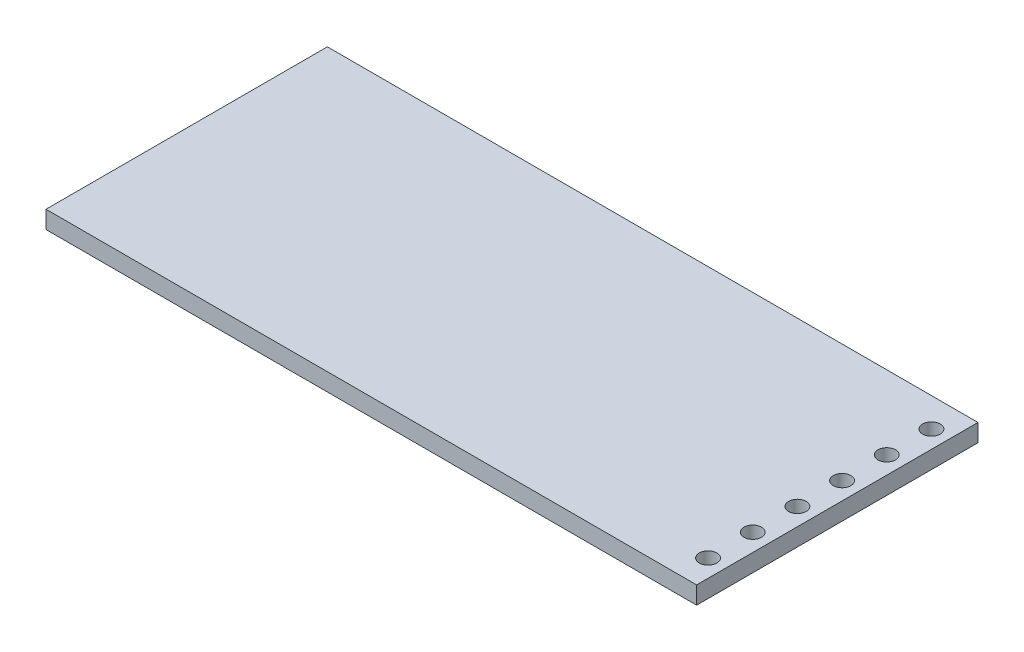
ISO-10303-21;
HEADER;
FILE_DESCRIPTION(('STEP AP214'),'2;1');
FILE_NAME('part.step','',(''),(''),'','','');
FILE_SCHEMA(('AUTOMOTIVE_DESIGN { 1 0 10303 214 1 1 1 1 }'));
ENDSEC;
DATA;
#1=APPLICATION_CONTEXT('core data for automotive mechanical design processes');
#2=APPLICATION_PROTOCOL_DEFINITION('international standard','automotive_design',2000,#1);
#3=PRODUCT_CONTEXT('',#1,'mechanical');
#4=PRODUCT('Part','Part','',(#3));
#5=PRODUCT_RELATED_PRODUCT_CATEGORY('part','',(#4));
#6=PRODUCT_DEFINITION_FORMATION('','',#4);
#7=PRODUCT_DEFINITION_CONTEXT('part definition',#1,'design');
#8=PRODUCT_DEFINITION('design','',#6,#7);
#9=PRODUCT_DEFINITION_SHAPE('','',#8);
#10=(LENGTH_UNIT() NAMED_UNIT(*) SI_UNIT(.MILLI.,.METRE.));
#11=(NAMED_UNIT(*) PLANE_ANGLE_UNIT() SI_UNIT($,.RADIAN.));
#12=(NAMED_UNIT(*) SI_UNIT($,.STERADIAN.) SOLID_ANGLE_UNIT());
#13=UNCERTAINTY_MEASURE_WITH_UNIT(LENGTH_MEASURE(1.E-05),#10,'distance_accuracy_value','');
#14=(GEOMETRIC_REPRESENTATION_CONTEXT(3) GLOBAL_UNCERTAINTY_ASSIGNED_CONTEXT((#13)) GLOBAL_UNIT_ASSIGNED_CONTEXT((#10,
#11,#12)) REPRESENTATION_CONTEXT('',''));
#15=CARTESIAN_POINT('',(0.,0.,0.));
#16=DIRECTION('',(0.,0.,1.));
#17=DIRECTION('',(1.,0.,0.));
#18=AXIS2_PLACEMENT_3D('',#15,#16,#17);
#19=CARTESIAN_POINT('',(18.5,1.,-8.));
#20=DIRECTION('',(-1.,0.,0.));
#21=DIRECTION('',(0.,0.,1.));
#22=AXIS2_PLACEMENT_3D('',#19,#20,#21);
#23=PLANE('',#22);
#24=DIRECTION('',(0.,0.,-1.));
#25=VECTOR('',#24,1.);
#26=CARTESIAN_POINT('',(18.5,0.,-8.));
#27=LINE('',#26,#25);
#28=CARTESIAN_POINT('',(18.5,0.,8.));
#29=VERTEX_POINT('',#28);
#30=CARTESIAN_POINT('',(18.5,0.,-8.));
#31=VERTEX_POINT('',#30);
#32=EDGE_CURVE('E102',#29,#31,#27,.T.);
#33=ORIENTED_EDGE('',*,*,#32,.T.);
#34=DIRECTION('',(0.,-1.,0.));
#35=VECTOR('',#34,1.);
#36=CARTESIAN_POINT('',(18.5,1.,-8.));
#37=LINE('',#36,#35);
#38=CARTESIAN_POINT('',(18.5,1.,-8.));
#39=VERTEX_POINT('',#38);
#40=EDGE_CURVE('E11',#39,#31,#37,.T.);
#41=ORIENTED_EDGE('',*,*,#40,.F.);
#42=DIRECTION('',(0.,0.,-1.));
#43=VECTOR('',#42,1.);
#44=CARTESIAN_POINT('',(18.5,1.,-8.));
#45=LINE('',#44,#43);
#46=CARTESIAN_POINT('',(18.5,1.,8.));
#47=VERTEX_POINT('',#46);
#48=EDGE_CURVE('E89',#47,#39,#45,.T.);
#49=ORIENTED_EDGE('',*,*,#48,.F.);
#50=DIRECTION('',(0.,-1.,0.));
#51=VECTOR('',#50,1.);
#52=CARTESIAN_POINT('',(18.5,1.,8.));
#53=LINE('',#52,#51);
#54=EDGE_CURVE('E98',#47,#29,#53,.T.);
#55=ORIENTED_EDGE('',*,*,#54,.T.);
#56=EDGE_LOOP('',(#33,#41,#49,#55));
#57=FACE_BOUND('',#56,.T.);
#58=ADVANCED_FACE('F36',(#57),#23,.F.);
#59=CARTESIAN_POINT('',(-18.5,1.,-8.));
#60=DIRECTION('',(0.,0.,1.));
#61=DIRECTION('',(1.,0.,0.));
#62=AXIS2_PLACEMENT_3D('',#59,#60,#61);
#63=PLANE('',#62);
#64=DIRECTION('',(-1.,0.,0.));
#65=VECTOR('',#64,1.);
#66=CARTESIAN_POINT('',(-18.5,0.,-8.));
#67=LINE('',#66,#65);
#68=CARTESIAN_POINT('',(-18.5,0.,-8.));
#69=VERTEX_POINT('',#68);
#70=EDGE_CURVE('E93',#31,#69,#67,.T.);
#71=ORIENTED_EDGE('',*,*,#70,.T.);
#72=DIRECTION('',(0.,-1.,0.));
#73=VECTOR('',#72,1.);
#74=CARTESIAN_POINT('',(-18.5,1.,-8.));
#75=LINE('',#74,#73);
#76=CARTESIAN_POINT('',(-18.5,1.,-8.));
#77=VERTEX_POINT('',#76);
#78=EDGE_CURVE('E45',#77,#69,#75,.T.);
#79=ORIENTED_EDGE('',*,*,#78,.F.);
#80=DIRECTION('',(-1.,0.,0.));
#81=VECTOR('',#80,1.);
#82=CARTESIAN_POINT('',(-18.5,1.,-8.));
#83=LINE('',#82,#81);
#84=EDGE_CURVE('E84',#39,#77,#83,.T.);
#85=ORIENTED_EDGE('',*,*,#84,.F.);
#86=ORIENTED_EDGE('',*,*,#40,.T.);
#87=EDGE_LOOP('',(#71,#79,#85,#86));
#88=FACE_BOUND('',#87,.T.);
#89=ADVANCED_FACE('F92',(#88),#63,.F.);
#90=CARTESIAN_POINT('',(-18.5,1.,-8.));
#91=DIRECTION('',(1.,0.,0.));
#92=DIRECTION('',(0.,0.,-1.));
#93=AXIS2_PLACEMENT_3D('',#90,#91,#92);
#94=PLANE('',#93);
#95=DIRECTION('',(0.,0.,1.));
#96=VECTOR('',#95,1.);
#97=CARTESIAN_POINT('',(-18.5,0.,-8.));
#98=LINE('',#97,#96);
#99=CARTESIAN_POINT('',(-18.5,0.,8.));
#100=VERTEX_POINT('',#99);
#101=EDGE_CURVE('E71',#69,#100,#98,.T.);
#102=ORIENTED_EDGE('',*,*,#101,.T.);
#103=DIRECTION('',(0.,-1.,0.));
#104=VECTOR('',#103,1.);
#105=CARTESIAN_POINT('',(-18.5,1.,8.));
#106=LINE('',#105,#104);
#107=CARTESIAN_POINT('',(-18.5,1.,8.));
#108=VERTEX_POINT('',#107);
#109=EDGE_CURVE('E94',#108,#100,#106,.T.);
#110=ORIENTED_EDGE('',*,*,#109,.F.);
#111=DIRECTION('',(0.,0.,1.));
#112=VECTOR('',#111,1.);
#113=CARTESIAN_POINT('',(-18.5,1.,-8.));
#114=LINE('',#113,#112);
#115=EDGE_CURVE('E87',#77,#108,#114,.T.);
#116=ORIENTED_EDGE('',*,*,#115,.F.);
#117=ORIENTED_EDGE('',*,*,#78,.T.);
#118=EDGE_LOOP('',(#102,#110,#116,#117));
#119=FACE_BOUND('',#118,.T.);
#120=ADVANCED_FACE('F96',(#119),#94,.F.);
#121=CARTESIAN_POINT('',(-18.5,1.,8.));
#122=DIRECTION('',(0.,0.,-1.));
#123=DIRECTION('',(-1.,0.,0.));
#124=AXIS2_PLACEMENT_3D('',#121,#122,#123);
#125=PLANE('',#124);
#126=DIRECTION('',(1.,0.,0.));
#127=VECTOR('',#126,1.);
#128=CARTESIAN_POINT('',(-18.5,0.,8.));
#129=LINE('',#128,#127);
#130=EDGE_CURVE('E77',#100,#29,#129,.T.);
#131=ORIENTED_EDGE('',*,*,#130,.T.);
#132=ORIENTED_EDGE('',*,*,#54,.F.);
#133=DIRECTION('',(1.,0.,0.));
#134=VECTOR('',#133,1.);
#135=CARTESIAN_POINT('',(-18.5,1.,8.));
#136=LINE('',#135,#134);
#137=EDGE_CURVE('E54',#108,#47,#136,.T.);
#138=ORIENTED_EDGE('',*,*,#137,.F.);
#139=ORIENTED_EDGE('',*,*,#109,.T.);
#140=EDGE_LOOP('',(#131,#132,#138,#139));
#141=FACE_BOUND('',#140,.T.);
#142=ADVANCED_FACE('F160',(#141),#125,.F.);
#143=CARTESIAN_POINT('',(0.,1.,0.));
#144=DIRECTION('',(0.,1.,0.));
#145=DIRECTION('',(0.,0.,1.));
#146=AXIS2_PLACEMENT_3D('',#143,#144,#145);
#147=PLANE('',#146);
#148=CARTESIAN_POINT('',(17.5,1.,6.35));
#149=DIRECTION('',(0.,1.,0.));
#150=DIRECTION('',(0.,0.,1.));
#151=AXIS2_PLACEMENT_3D('',#148,#149,#150);
#152=CIRCLE('',#151,0.499999999999999);
#153=CARTESIAN_POINT('',(17.5,1.,6.85));
#154=VERTEX_POINT('',#153);
#155=EDGE_CURVE('E114',#154,#154,#152,.T.);
#156=ORIENTED_EDGE('',*,*,#155,.F.);
#157=EDGE_LOOP('',(#156));
#158=FACE_BOUND('',#157,.T.);
#159=CARTESIAN_POINT('',(17.5,1.,3.81));
#160=DIRECTION('',(0.,1.,0.));
#161=DIRECTION('',(0.,0.,1.));
#162=AXIS2_PLACEMENT_3D('',#159,#160,#161);
#163=CIRCLE('',#162,0.499999999999999);
#164=CARTESIAN_POINT('',(17.5,1.,4.31));
#165=VERTEX_POINT('',#164);
#166=EDGE_CURVE('E262',#165,#165,#163,.T.);
#167=ORIENTED_EDGE('',*,*,#166,.F.);
#168=EDGE_LOOP('',(#167));
#169=FACE_BOUND('',#168,.T.);
#170=CARTESIAN_POINT('',(17.5,1.,1.27));
#171=DIRECTION('',(0.,1.,0.));
#172=DIRECTION('',(0.,0.,1.));
#173=AXIS2_PLACEMENT_3D('',#170,#171,#172);
#174=CIRCLE('',#173,0.499999999999999);
#175=CARTESIAN_POINT('',(17.5,1.,1.77));
#176=VERTEX_POINT('',#175);
#177=EDGE_CURVE('E249',#176,#176,#174,.T.);
#178=ORIENTED_EDGE('',*,*,#177,.F.);
#179=EDGE_LOOP('',(#178));
#180=FACE_BOUND('',#179,.T.);
#181=CARTESIAN_POINT('',(17.5,1.,-1.27));
#182=DIRECTION('',(0.,1.,0.));
#183=DIRECTION('',(0.,0.,1.));
#184=AXIS2_PLACEMENT_3D('',#181,#182,#183);
#185=CIRCLE('',#184,0.499999999999999);
#186=CARTESIAN_POINT('',(17.5,1.,-0.770000000000001));
#187=VERTEX_POINT('',#186);
#188=EDGE_CURVE('E263',#187,#187,#185,.T.);
#189=ORIENTED_EDGE('',*,*,#188,.F.);
#190=EDGE_LOOP('',(#189));
#191=FACE_BOUND('',#190,.T.);
#192=CARTESIAN_POINT('',(17.5,1.,-3.81));
#193=DIRECTION('',(0.,1.,0.));
#194=DIRECTION('',(0.,0.,1.));
#195=AXIS2_PLACEMENT_3D('',#192,#193,#194);
#196=CIRCLE('',#195,0.499999999999999);
#197=CARTESIAN_POINT('',(17.5,1.,-3.31));
#198=VERTEX_POINT('',#197);
#199=EDGE_CURVE('E268',#198,#198,#196,.T.);
#200=ORIENTED_EDGE('',*,*,#199,.F.);
#201=EDGE_LOOP('',(#200));
#202=FACE_BOUND('',#201,.T.);
#203=CARTESIAN_POINT('',(17.5,1.,-6.35));
#204=DIRECTION('',(0.,1.,0.));
#205=DIRECTION('',(0.,0.,1.));
#206=AXIS2_PLACEMENT_3D('',#203,#204,#205);
#207=CIRCLE('',#206,0.499999999999999);
#208=CARTESIAN_POINT('',(17.5,1.,-5.85));
#209=VERTEX_POINT('',#208);
#210=EDGE_CURVE('E274',#209,#209,#207,.T.);
#211=ORIENTED_EDGE('',*,*,#210,.F.);
#212=EDGE_LOOP('',(#211));
#213=FACE_BOUND('',#212,.T.);
#214=ORIENTED_EDGE('',*,*,#48,.T.);
#215=ORIENTED_EDGE('',*,*,#84,.T.);
#216=ORIENTED_EDGE('',*,*,#115,.T.);
#217=ORIENTED_EDGE('',*,*,#137,.T.);
#218=EDGE_LOOP('',(#214,#215,#216,#217));
#219=FACE_BOUND('',#218,.T.);
#220=ADVANCED_FACE('F85',(#158,#169,#180,#191,#202,#213,#219),#147,.T.);
#221=CARTESIAN_POINT('',(0.,0.,0.));
#222=DIRECTION('',(0.,1.,0.));
#223=DIRECTION('',(0.,0.,1.));
#224=AXIS2_PLACEMENT_3D('',#221,#222,#223);
#225=PLANE('',#224);
#226=CARTESIAN_POINT('',(17.5,0.,6.35));
#227=DIRECTION('',(0.,1.,0.));
#228=DIRECTION('',(0.,0.,1.));
#229=AXIS2_PLACEMENT_3D('',#226,#227,#228);
#230=CIRCLE('',#229,0.499999999999999);
#231=CARTESIAN_POINT('',(17.5,0.,6.85));
#232=VERTEX_POINT('',#231);
#233=EDGE_CURVE('E39',#232,#232,#230,.T.);
#234=ORIENTED_EDGE('',*,*,#233,.T.);
#235=EDGE_LOOP('',(#234));
#236=FACE_BOUND('',#235,.T.);
#237=CARTESIAN_POINT('',(17.5,0.,3.81));
#238=DIRECTION('',(0.,1.,0.));
#239=DIRECTION('',(0.,0.,1.));
#240=AXIS2_PLACEMENT_3D('',#237,#238,#239);
#241=CIRCLE('',#240,0.499999999999999);
#242=CARTESIAN_POINT('',(17.5,0.,4.31));
#243=VERTEX_POINT('',#242);
#244=EDGE_CURVE('E122',#243,#243,#241,.T.);
#245=ORIENTED_EDGE('',*,*,#244,.T.);
#246=EDGE_LOOP('',(#245));
#247=FACE_BOUND('',#246,.T.);
#248=CARTESIAN_POINT('',(17.5,0.,1.27));
#249=DIRECTION('',(0.,1.,0.));
#250=DIRECTION('',(0.,0.,1.));
#251=AXIS2_PLACEMENT_3D('',#248,#249,#250);
#252=CIRCLE('',#251,0.499999999999999);
#253=CARTESIAN_POINT('',(17.5,0.,1.77));
#254=VERTEX_POINT('',#253);
#255=EDGE_CURVE('E120',#254,#254,#252,.T.);
#256=ORIENTED_EDGE('',*,*,#255,.T.);
#257=EDGE_LOOP('',(#256));
#258=FACE_BOUND('',#257,.T.);
#259=CARTESIAN_POINT('',(17.5,0.,-1.27));
#260=DIRECTION('',(0.,1.,0.));
#261=DIRECTION('',(0.,0.,1.));
#262=AXIS2_PLACEMENT_3D('',#259,#260,#261);
#263=CIRCLE('',#262,0.499999999999999);
#264=CARTESIAN_POINT('',(17.5,0.,-0.770000000000001));
#265=VERTEX_POINT('',#264);
#266=EDGE_CURVE('E117',#265,#265,#263,.T.);
#267=ORIENTED_EDGE('',*,*,#266,.T.);
#268=EDGE_LOOP('',(#267));
#269=FACE_BOUND('',#268,.T.);
#270=CARTESIAN_POINT('',(17.5,0.,-3.81));
#271=DIRECTION('',(0.,1.,0.));
#272=DIRECTION('',(0.,0.,1.));
#273=AXIS2_PLACEMENT_3D('',#270,#271,#272);
#274=CIRCLE('',#273,0.499999999999999);
#275=CARTESIAN_POINT('',(17.5,0.,-3.31));
#276=VERTEX_POINT('',#275);
#277=EDGE_CURVE('E113',#276,#276,#274,.T.);
#278=ORIENTED_EDGE('',*,*,#277,.T.);
#279=EDGE_LOOP('',(#278));
#280=FACE_BOUND('',#279,.T.);
#281=CARTESIAN_POINT('',(17.5,0.,-6.35));
#282=DIRECTION('',(0.,1.,0.));
#283=DIRECTION('',(0.,0.,1.));
#284=AXIS2_PLACEMENT_3D('',#281,#282,#283);
#285=CIRCLE('',#284,0.499999999999999);
#286=CARTESIAN_POINT('',(17.5,0.,-5.85));
#287=VERTEX_POINT('',#286);
#288=EDGE_CURVE('E110',#287,#287,#285,.T.);
#289=ORIENTED_EDGE('',*,*,#288,.T.);
#290=EDGE_LOOP('',(#289));
#291=FACE_BOUND('',#290,.T.);
#292=ORIENTED_EDGE('',*,*,#32,.F.);
#293=ORIENTED_EDGE('',*,*,#130,.F.);
#294=ORIENTED_EDGE('',*,*,#101,.F.);
#295=ORIENTED_EDGE('',*,*,#70,.F.);
#296=EDGE_LOOP('',(#292,#293,#294,#295));
#297=FACE_BOUND('',#296,.T.);
#298=ADVANCED_FACE('F129',(#236,#247,#258,#269,#280,#291,#297),#225,.F.);
#299=CARTESIAN_POINT('',(17.5,-9.,-6.35));
#300=DIRECTION('',(0.,1.,0.));
#301=DIRECTION('',(0.,0.,1.));
#302=AXIS2_PLACEMENT_3D('',#299,#300,#301);
#303=CYLINDRICAL_SURFACE('',#302,0.499999999999999);
#304=ORIENTED_EDGE('',*,*,#210,.T.);
#305=EDGE_LOOP('',(#304));
#306=FACE_BOUND('',#305,.T.);
#307=ORIENTED_EDGE('',*,*,#288,.F.);
#308=EDGE_LOOP('',(#307));
#309=FACE_BOUND('',#308,.T.);
#310=ADVANCED_FACE('F151',(#306,#309),#303,.F.);
#311=CARTESIAN_POINT('',(17.5,-9.,-3.81));
#312=DIRECTION('',(0.,1.,0.));
#313=DIRECTION('',(0.,0.,1.));
#314=AXIS2_PLACEMENT_3D('',#311,#312,#313);
#315=CYLINDRICAL_SURFACE('',#314,0.499999999999999);
#316=ORIENTED_EDGE('',*,*,#199,.T.);
#317=EDGE_LOOP('',(#316));
#318=FACE_BOUND('',#317,.T.);
#319=ORIENTED_EDGE('',*,*,#277,.F.);
#320=EDGE_LOOP('',(#319));
#321=FACE_BOUND('',#320,.T.);
#322=ADVANCED_FACE('F157',(#318,#321),#315,.F.);
#323=CARTESIAN_POINT('',(17.5,-9.,-1.27));
#324=DIRECTION('',(0.,1.,0.));
#325=DIRECTION('',(0.,0.,1.));
#326=AXIS2_PLACEMENT_3D('',#323,#324,#325);
#327=CYLINDRICAL_SURFACE('',#326,0.499999999999999);
#328=ORIENTED_EDGE('',*,*,#188,.T.);
#329=EDGE_LOOP('',(#328));
#330=FACE_BOUND('',#329,.T.);
#331=ORIENTED_EDGE('',*,*,#266,.F.);
#332=EDGE_LOOP('',(#331));
#333=FACE_BOUND('',#332,.T.);
#334=ADVANCED_FACE('F213',(#330,#333),#327,.F.);
#335=CARTESIAN_POINT('',(17.5,-9.,1.27));
#336=DIRECTION('',(0.,1.,0.));
#337=DIRECTION('',(0.,0.,1.));
#338=AXIS2_PLACEMENT_3D('',#335,#336,#337);
#339=CYLINDRICAL_SURFACE('',#338,0.499999999999999);
#340=ORIENTED_EDGE('',*,*,#177,.T.);
#341=EDGE_LOOP('',(#340));
#342=FACE_BOUND('',#341,.T.);
#343=ORIENTED_EDGE('',*,*,#255,.F.);
#344=EDGE_LOOP('',(#343));
#345=FACE_BOUND('',#344,.T.);
#346=ADVANCED_FACE('F139',(#342,#345),#339,.F.);
#347=CARTESIAN_POINT('',(17.5,-9.,3.81));
#348=DIRECTION('',(0.,1.,0.));
#349=DIRECTION('',(0.,0.,1.));
#350=AXIS2_PLACEMENT_3D('',#347,#348,#349);
#351=CYLINDRICAL_SURFACE('',#350,0.499999999999999);
#352=ORIENTED_EDGE('',*,*,#166,.T.);
#353=EDGE_LOOP('',(#352));
#354=FACE_BOUND('',#353,.T.);
#355=ORIENTED_EDGE('',*,*,#244,.F.);
#356=EDGE_LOOP('',(#355));
#357=FACE_BOUND('',#356,.T.);
#358=ADVANCED_FACE('F133',(#354,#357),#351,.F.);
#359=CARTESIAN_POINT('',(17.5,-9.,6.35));
#360=DIRECTION('',(0.,1.,0.));
#361=DIRECTION('',(0.,0.,1.));
#362=AXIS2_PLACEMENT_3D('',#359,#360,#361);
#363=CYLINDRICAL_SURFACE('',#362,0.499999999999999);
#364=ORIENTED_EDGE('',*,*,#155,.T.);
#365=EDGE_LOOP('',(#364));
#366=FACE_BOUND('',#365,.T.);
#367=ORIENTED_EDGE('',*,*,#233,.F.);
#368=EDGE_LOOP('',(#367));
#369=FACE_BOUND('',#368,.T.);
#370=ADVANCED_FACE('F131',(#366,#369),#363,.F.);
#371=CLOSED_SHELL('',(#58,#89,#120,#142,#220,#298,#310,#322,#334,#346,#358,#370));
#372=MANIFOLD_SOLID_BREP('B2',#371);
#373=ADVANCED_BREP_SHAPE_REPRESENTATION('',(#18,#372),#14);
#374=SHAPE_DEFINITION_REPRESENTATION(#9,#373);
ENDSEC;
END-ISO-10303-21;
